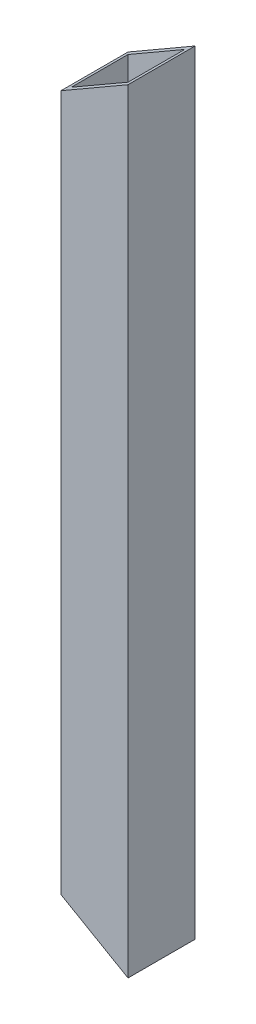
ISO-10303-21;
HEADER;
FILE_DESCRIPTION(('STEP AP214'),'2;1');
FILE_NAME('part.step','',(''),(''),'','','');
FILE_SCHEMA(('AUTOMOTIVE_DESIGN { 1 0 10303 214 1 1 1 1 }'));
ENDSEC;
DATA;
#1=APPLICATION_CONTEXT('core data for automotive mechanical design processes');
#2=APPLICATION_PROTOCOL_DEFINITION('international standard','automotive_design',2000,#1);
#3=PRODUCT_CONTEXT('',#1,'mechanical');
#4=PRODUCT('Part','Part','',(#3));
#5=PRODUCT_RELATED_PRODUCT_CATEGORY('part','',(#4));
#6=PRODUCT_DEFINITION_FORMATION('','',#4);
#7=PRODUCT_DEFINITION_CONTEXT('part definition',#1,'design');
#8=PRODUCT_DEFINITION('design','',#6,#7);
#9=PRODUCT_DEFINITION_SHAPE('','',#8);
#10=(LENGTH_UNIT() NAMED_UNIT(*) SI_UNIT(.MILLI.,.METRE.));
#11=(NAMED_UNIT(*) PLANE_ANGLE_UNIT() SI_UNIT($,.RADIAN.));
#12=(NAMED_UNIT(*) SI_UNIT($,.STERADIAN.) SOLID_ANGLE_UNIT());
#13=UNCERTAINTY_MEASURE_WITH_UNIT(LENGTH_MEASURE(1.E-05),#10,'distance_accuracy_value','');
#14=(GEOMETRIC_REPRESENTATION_CONTEXT(3) GLOBAL_UNCERTAINTY_ASSIGNED_CONTEXT((#13)) GLOBAL_UNIT_ASSIGNED_CONTEXT((#10,
#11,#12)) REPRESENTATION_CONTEXT('',''));
#15=CARTESIAN_POINT('',(0.,0.,0.));
#16=DIRECTION('',(0.,0.,1.));
#17=DIRECTION('',(1.,0.,0.));
#18=AXIS2_PLACEMENT_3D('',#15,#16,#17);
#19=CARTESIAN_POINT('',(-6.5,150.,-6.5));
#20=DIRECTION('',(1.,0.,0.));
#21=DIRECTION('',(0.,0.,-1.));
#22=AXIS2_PLACEMENT_3D('',#19,#20,#21);
#23=PLANE('',#22);
#24=DIRECTION('',(0.,0.,1.));
#25=VECTOR('',#24,1.);
#26=CARTESIAN_POINT('',(-6.5,7.50555349946502,-6.50000000000001));
#27=LINE('',#26,#25);
#28=CARTESIAN_POINT('',(-6.5,7.50555349946502,-6.5));
#29=VERTEX_POINT('',#28);
#30=CARTESIAN_POINT('',(-6.5,7.50555349946502,6.5));
#31=VERTEX_POINT('',#30);
#32=EDGE_CURVE('E55',#29,#31,#27,.T.);
#33=ORIENTED_EDGE('',*,*,#32,.T.);
#34=DIRECTION('',(0.,-1.,0.));
#35=VECTOR('',#34,1.);
#36=CARTESIAN_POINT('',(-6.5,150.,6.5));
#37=LINE('',#36,#35);
#38=CARTESIAN_POINT('',(-6.5,142.494446500535,6.50000000000001));
#39=VERTEX_POINT('',#38);
#40=EDGE_CURVE('E132',#39,#31,#37,.T.);
#41=ORIENTED_EDGE('',*,*,#40,.F.);
#42=DIRECTION('',(0.,0.,-1.));
#43=VECTOR('',#42,1.);
#44=CARTESIAN_POINT('',(-6.5,142.494446500535,195.40308361697));
#45=LINE('',#44,#43);
#46=CARTESIAN_POINT('',(-6.5,142.494446500535,-6.50000000000001));
#47=VERTEX_POINT('',#46);
#48=EDGE_CURVE('E180',#39,#47,#45,.T.);
#49=ORIENTED_EDGE('',*,*,#48,.T.);
#50=DIRECTION('',(0.,-1.,0.));
#51=VECTOR('',#50,1.);
#52=CARTESIAN_POINT('',(-6.5,150.,-6.5));
#53=LINE('',#52,#51);
#54=EDGE_CURVE('E128',#47,#29,#53,.T.);
#55=ORIENTED_EDGE('',*,*,#54,.T.);
#56=EDGE_LOOP('',(#33,#41,#49,#55));
#57=FACE_BOUND('',#56,.T.);
#58=ADVANCED_FACE('F40',(#57),#23,.F.);
#59=CARTESIAN_POINT('',(-6.5,150.,6.5));
#60=DIRECTION('',(0.,0.,-1.));
#61=DIRECTION('',(-1.,0.,0.));
#62=AXIS2_PLACEMENT_3D('',#59,#60,#61);
#63=PLANE('',#62);
#64=DIRECTION('',(-0.866025403784442,0.499999999999995,0.));
#65=VECTOR('',#64,1.);
#66=CARTESIAN_POINT('',(-68.2019052838325,43.129165124598,6.5));
#67=LINE('',#66,#65);
#68=CARTESIAN_POINT('',(6.5,0.,6.5));
#69=VERTEX_POINT('',#68);
#70=EDGE_CURVE('E184',#69,#31,#67,.T.);
#71=ORIENTED_EDGE('',*,*,#70,.F.);
#72=DIRECTION('',(0.,-1.,0.));
#73=VECTOR('',#72,1.);
#74=CARTESIAN_POINT('',(6.5,150.,6.5));
#75=LINE('',#74,#73);
#76=CARTESIAN_POINT('',(6.5,150.,6.50000000000001));
#77=VERTEX_POINT('',#76);
#78=EDGE_CURVE('E119',#77,#69,#75,.T.);
#79=ORIENTED_EDGE('',*,*,#78,.F.);
#80=DIRECTION('',(-0.866025403784444,-0.49999999999999,0.));
#81=VECTOR('',#80,1.);
#82=CARTESIAN_POINT('',(-3.25000000000013,144.370834875401,6.5));
#83=LINE('',#82,#81);
#84=EDGE_CURVE('E163',#77,#39,#83,.T.);
#85=ORIENTED_EDGE('',*,*,#84,.T.);
#86=ORIENTED_EDGE('',*,*,#40,.T.);
#87=EDGE_LOOP('',(#71,#79,#85,#86));
#88=FACE_BOUND('',#87,.T.);
#89=ADVANCED_FACE('F183',(#88),#63,.F.);
#90=CARTESIAN_POINT('',(-6.5,150.,-6.5));
#91=DIRECTION('',(0.,0.,1.));
#92=DIRECTION('',(1.,0.,0.));
#93=AXIS2_PLACEMENT_3D('',#90,#91,#92);
#94=PLANE('',#93);
#95=DIRECTION('',(0.866025403784442,-0.499999999999994,0.));
#96=VECTOR('',#95,1.);
#97=CARTESIAN_POINT('',(6.5,0.,-6.50000000000001));
#98=LINE('',#97,#96);
#99=CARTESIAN_POINT('',(6.5,0.,-6.50000000000001));
#100=VERTEX_POINT('',#99);
#101=EDGE_CURVE('E101',#29,#100,#98,.T.);
#102=ORIENTED_EDGE('',*,*,#101,.F.);
#103=ORIENTED_EDGE('',*,*,#54,.F.);
#104=DIRECTION('',(0.866025403784444,0.49999999999999,0.));
#105=VECTOR('',#104,1.);
#106=CARTESIAN_POINT('',(-3.25000000000013,144.370834875401,-6.5));
#107=LINE('',#106,#105);
#108=CARTESIAN_POINT('',(6.5,150.,-6.5));
#109=VERTEX_POINT('',#108);
#110=EDGE_CURVE('E126',#47,#109,#107,.T.);
#111=ORIENTED_EDGE('',*,*,#110,.T.);
#112=DIRECTION('',(0.,-1.,0.));
#113=VECTOR('',#112,1.);
#114=CARTESIAN_POINT('',(6.5,150.,-6.5));
#115=LINE('',#114,#113);
#116=EDGE_CURVE('E117',#109,#100,#115,.T.);
#117=ORIENTED_EDGE('',*,*,#116,.T.);
#118=EDGE_LOOP('',(#102,#103,#111,#117));
#119=FACE_BOUND('',#118,.T.);
#120=ADVANCED_FACE('F125',(#119),#94,.F.);
#121=CARTESIAN_POINT('',(5.5,150.,-5.5));
#122=DIRECTION('',(-1.,0.,0.));
#123=DIRECTION('',(0.,0.,1.));
#124=AXIS2_PLACEMENT_3D('',#121,#122,#123);
#125=PLANE('',#124);
#126=DIRECTION('',(0.,-1.,0.));
#127=VECTOR('',#126,1.);
#128=CARTESIAN_POINT('',(5.5,150.,-5.5));
#129=LINE('',#128,#127);
#130=CARTESIAN_POINT('',(5.5,149.42264973081,-5.5));
#131=VERTEX_POINT('',#130);
#132=CARTESIAN_POINT('',(5.50000000000001,0.577350269189633,-5.5));
#133=VERTEX_POINT('',#132);
#134=EDGE_CURVE('E122',#131,#133,#129,.T.);
#135=ORIENTED_EDGE('',*,*,#134,.T.);
#136=DIRECTION('',(0.,0.,1.));
#137=VECTOR('',#136,1.);
#138=CARTESIAN_POINT('',(5.5,0.577350269189647,-5.50000000000002));
#139=LINE('',#138,#137);
#140=CARTESIAN_POINT('',(5.50000000000001,0.577350269189633,5.5));
#141=VERTEX_POINT('',#140);
#142=EDGE_CURVE('E161',#133,#141,#139,.T.);
#143=ORIENTED_EDGE('',*,*,#142,.T.);
#144=DIRECTION('',(0.,-1.,0.));
#145=VECTOR('',#144,1.);
#146=CARTESIAN_POINT('',(5.5,150.,5.5));
#147=LINE('',#146,#145);
#148=CARTESIAN_POINT('',(5.5,149.42264973081,5.5));
#149=VERTEX_POINT('',#148);
#150=EDGE_CURVE('E153',#149,#141,#147,.T.);
#151=ORIENTED_EDGE('',*,*,#150,.F.);
#152=DIRECTION('',(0.,0.,1.));
#153=VECTOR('',#152,1.);
#154=CARTESIAN_POINT('',(5.5,149.42264973081,-5.5));
#155=LINE('',#154,#153);
#156=EDGE_CURVE('E148',#131,#149,#155,.T.);
#157=ORIENTED_EDGE('',*,*,#156,.F.);
#158=EDGE_LOOP('',(#135,#143,#151,#157));
#159=FACE_BOUND('',#158,.T.);
#160=ADVANCED_FACE('F159',(#159),#125,.T.);
#161=CARTESIAN_POINT('',(-5.5,150.,-5.5));
#162=DIRECTION('',(0.,0.,1.));
#163=DIRECTION('',(1.,0.,0.));
#164=AXIS2_PLACEMENT_3D('',#161,#162,#163);
#165=PLANE('',#164);
#166=DIRECTION('',(0.,-1.,0.));
#167=VECTOR('',#166,1.);
#168=CARTESIAN_POINT('',(-5.5,150.,-5.5));
#169=LINE('',#168,#167);
#170=CARTESIAN_POINT('',(-5.5,143.071796769725,-5.5));
#171=VERTEX_POINT('',#170);
#172=CARTESIAN_POINT('',(-5.5,6.92820323027543,-5.5));
#173=VERTEX_POINT('',#172);
#174=EDGE_CURVE('E167',#171,#173,#169,.T.);
#175=ORIENTED_EDGE('',*,*,#174,.T.);
#176=DIRECTION('',(0.866025403784442,-0.499999999999995,0.));
#177=VECTOR('',#176,1.);
#178=CARTESIAN_POINT('',(-67.4519052838325,42.6961524227058,-5.5));
#179=LINE('',#178,#177);
#180=EDGE_CURVE('E190',#173,#133,#179,.T.);
#181=ORIENTED_EDGE('',*,*,#180,.T.);
#182=ORIENTED_EDGE('',*,*,#134,.F.);
#183=DIRECTION('',(0.866025403784444,0.49999999999999,0.));
#184=VECTOR('',#183,1.);
#185=CARTESIAN_POINT('',(-2.50000000000012,144.803847577293,-5.5));
#186=LINE('',#185,#184);
#187=EDGE_CURVE('E196',#171,#131,#186,.T.);
#188=ORIENTED_EDGE('',*,*,#187,.F.);
#189=EDGE_LOOP('',(#175,#181,#182,#188));
#190=FACE_BOUND('',#189,.T.);
#191=ADVANCED_FACE('F203',(#190),#165,.T.);
#192=CARTESIAN_POINT('',(-5.5,150.,-5.5));
#193=DIRECTION('',(1.,0.,0.));
#194=DIRECTION('',(0.,0.,-1.));
#195=AXIS2_PLACEMENT_3D('',#192,#193,#194);
#196=PLANE('',#195);
#197=DIRECTION('',(0.,-1.,0.));
#198=VECTOR('',#197,1.);
#199=CARTESIAN_POINT('',(-5.5,150.,5.5));
#200=LINE('',#199,#198);
#201=CARTESIAN_POINT('',(-5.5,143.071796769725,5.5));
#202=VERTEX_POINT('',#201);
#203=CARTESIAN_POINT('',(-5.5,6.92820323027546,5.5));
#204=VERTEX_POINT('',#203);
#205=EDGE_CURVE('E155',#202,#204,#200,.T.);
#206=ORIENTED_EDGE('',*,*,#205,.T.);
#207=DIRECTION('',(0.,0.,-1.));
#208=VECTOR('',#207,1.);
#209=CARTESIAN_POINT('',(-5.5,6.92820323027543,-5.50000000000001));
#210=LINE('',#209,#208);
#211=EDGE_CURVE('E63',#204,#173,#210,.T.);
#212=ORIENTED_EDGE('',*,*,#211,.T.);
#213=ORIENTED_EDGE('',*,*,#174,.F.);
#214=DIRECTION('',(0.,0.,-1.));
#215=VECTOR('',#214,1.);
#216=CARTESIAN_POINT('',(-5.5,143.071796769725,-5.5));
#217=LINE('',#216,#215);
#218=EDGE_CURVE('E147',#202,#171,#217,.T.);
#219=ORIENTED_EDGE('',*,*,#218,.F.);
#220=EDGE_LOOP('',(#206,#212,#213,#219));
#221=FACE_BOUND('',#220,.T.);
#222=ADVANCED_FACE('F206',(#221),#196,.T.);
#223=CARTESIAN_POINT('',(-5.5,150.,5.5));
#224=DIRECTION('',(0.,0.,-1.));
#225=DIRECTION('',(-1.,0.,0.));
#226=AXIS2_PLACEMENT_3D('',#223,#224,#225);
#227=PLANE('',#226);
#228=ORIENTED_EDGE('',*,*,#150,.T.);
#229=DIRECTION('',(-0.866025403784442,0.499999999999995,0.));
#230=VECTOR('',#229,1.);
#231=CARTESIAN_POINT('',(-67.4519052838325,42.6961524227058,5.5));
#232=LINE('',#231,#230);
#233=EDGE_CURVE('E12',#141,#204,#232,.T.);
#234=ORIENTED_EDGE('',*,*,#233,.T.);
#235=ORIENTED_EDGE('',*,*,#205,.F.);
#236=DIRECTION('',(-0.866025403784444,-0.49999999999999,0.));
#237=VECTOR('',#236,1.);
#238=CARTESIAN_POINT('',(-2.50000000000012,144.803847577293,5.5));
#239=LINE('',#238,#237);
#240=EDGE_CURVE('E48',#149,#202,#239,.T.);
#241=ORIENTED_EDGE('',*,*,#240,.F.);
#242=EDGE_LOOP('',(#228,#234,#235,#241));
#243=FACE_BOUND('',#242,.T.);
#244=ADVANCED_FACE('F152',(#243),#227,.T.);
#245=CARTESIAN_POINT('',(6.5,150.,-6.5));
#246=DIRECTION('',(-1.,0.,0.));
#247=DIRECTION('',(0.,0.,1.));
#248=AXIS2_PLACEMENT_3D('',#245,#246,#247);
#249=PLANE('',#248);
#250=DIRECTION('',(0.,0.,-1.));
#251=VECTOR('',#250,1.);
#252=CARTESIAN_POINT('',(6.5,0.,-6.5));
#253=LINE('',#252,#251);
#254=EDGE_CURVE('E104',#69,#100,#253,.T.);
#255=ORIENTED_EDGE('',*,*,#254,.T.);
#256=ORIENTED_EDGE('',*,*,#116,.F.);
#257=DIRECTION('',(0.,0.,-1.));
#258=VECTOR('',#257,1.);
#259=CARTESIAN_POINT('',(6.5,150.,-6.5));
#260=LINE('',#259,#258);
#261=EDGE_CURVE('E121',#77,#109,#260,.T.);
#262=ORIENTED_EDGE('',*,*,#261,.F.);
#263=ORIENTED_EDGE('',*,*,#78,.T.);
#264=EDGE_LOOP('',(#255,#256,#262,#263));
#265=FACE_BOUND('',#264,.T.);
#266=ADVANCED_FACE('F115',(#265),#249,.F.);
#267=CARTESIAN_POINT('',(6.5,150.,195.40308361697));
#268=DIRECTION('',(0.49999999999999,-0.866025403784444,0.));
#269=DIRECTION('',(0.866025403784444,0.49999999999999,0.));
#270=AXIS2_PLACEMENT_3D('',#267,#268,#269);
#271=PLANE('',#270);
#272=ORIENTED_EDGE('',*,*,#187,.T.);
#273=ORIENTED_EDGE('',*,*,#156,.T.);
#274=ORIENTED_EDGE('',*,*,#240,.T.);
#275=ORIENTED_EDGE('',*,*,#218,.T.);
#276=EDGE_LOOP('',(#272,#273,#274,#275));
#277=FACE_BOUND('',#276,.T.);
#278=ORIENTED_EDGE('',*,*,#84,.F.);
#279=ORIENTED_EDGE('',*,*,#261,.T.);
#280=ORIENTED_EDGE('',*,*,#110,.F.);
#281=ORIENTED_EDGE('',*,*,#48,.F.);
#282=EDGE_LOOP('',(#278,#279,#280,#281));
#283=FACE_BOUND('',#282,.T.);
#284=ADVANCED_FACE('F144',(#277,#283),#271,.F.);
#285=CARTESIAN_POINT('',(6.5,0.,-6.50000000000001));
#286=DIRECTION('',(-0.499999999999994,-0.866025403784442,0.));
#287=DIRECTION('',(0.866025403784442,-0.499999999999995,0.));
#288=AXIS2_PLACEMENT_3D('',#285,#286,#287);
#289=PLANE('',#288);
#290=ORIENTED_EDGE('',*,*,#180,.F.);
#291=ORIENTED_EDGE('',*,*,#211,.F.);
#292=ORIENTED_EDGE('',*,*,#233,.F.);
#293=ORIENTED_EDGE('',*,*,#142,.F.);
#294=EDGE_LOOP('',(#290,#291,#292,#293));
#295=FACE_BOUND('',#294,.T.);
#296=ORIENTED_EDGE('',*,*,#70,.T.);
#297=ORIENTED_EDGE('',*,*,#32,.F.);
#298=ORIENTED_EDGE('',*,*,#101,.T.);
#299=ORIENTED_EDGE('',*,*,#254,.F.);
#300=EDGE_LOOP('',(#296,#297,#298,#299));
#301=FACE_BOUND('',#300,.T.);
#302=ADVANCED_FACE('F103',(#295,#301),#289,.T.);
#303=CLOSED_SHELL('',(#58,#89,#120,#160,#191,#222,#244,#266,#284,#302));
#304=MANIFOLD_SOLID_BREP('B2',#303);
#305=ADVANCED_BREP_SHAPE_REPRESENTATION('',(#18,#304),#14);
#306=SHAPE_DEFINITION_REPRESENTATION(#9,#305);
ENDSEC;
END-ISO-10303-21;
